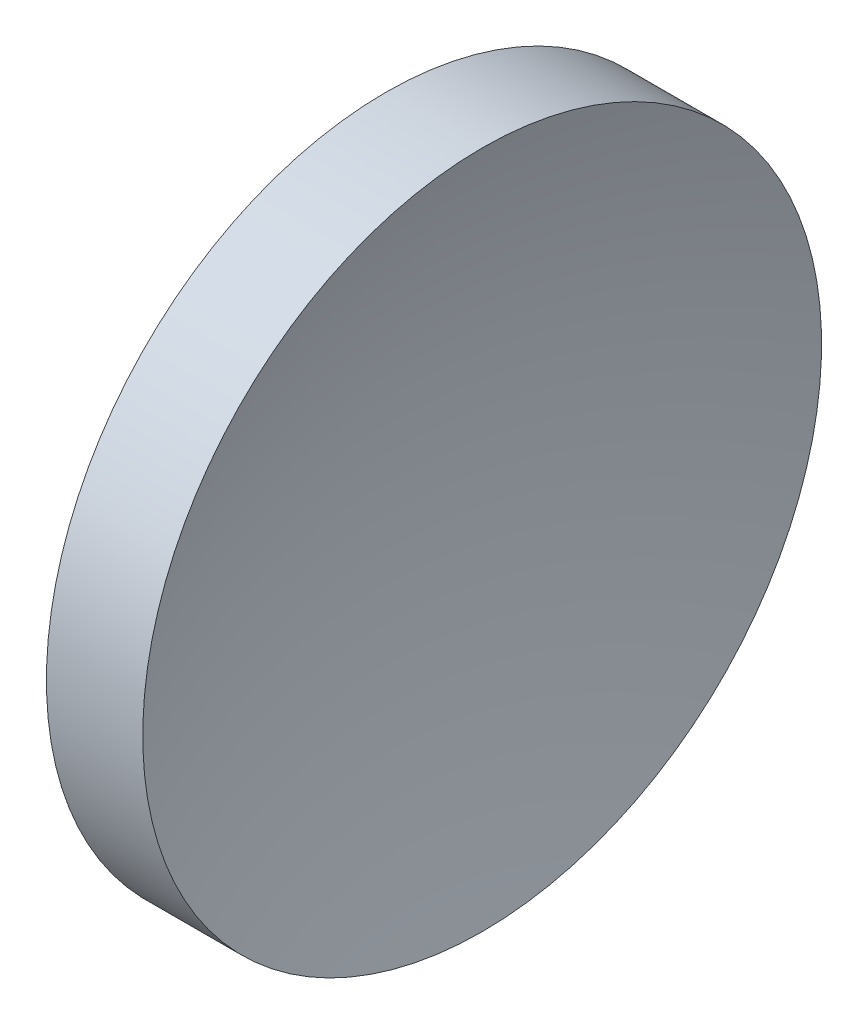
ISO-10303-21;
HEADER;
FILE_DESCRIPTION(('STEP AP214'),'2;1');
FILE_NAME('part.step','',(''),(''),'','','');
FILE_SCHEMA(('AUTOMOTIVE_DESIGN { 1 0 10303 214 1 1 1 1 }'));
ENDSEC;
DATA;
#1=APPLICATION_CONTEXT('core data for automotive mechanical design processes');
#2=APPLICATION_PROTOCOL_DEFINITION('international standard','automotive_design',2000,#1);
#3=PRODUCT_CONTEXT('',#1,'mechanical');
#4=PRODUCT('Part','Part','',(#3));
#5=PRODUCT_RELATED_PRODUCT_CATEGORY('part','',(#4));
#6=PRODUCT_DEFINITION_FORMATION('','',#4);
#7=PRODUCT_DEFINITION_CONTEXT('part definition',#1,'design');
#8=PRODUCT_DEFINITION('design','',#6,#7);
#9=PRODUCT_DEFINITION_SHAPE('','',#8);
#10=(LENGTH_UNIT() NAMED_UNIT(*) SI_UNIT(.MILLI.,.METRE.));
#11=(NAMED_UNIT(*) PLANE_ANGLE_UNIT() SI_UNIT($,.RADIAN.));
#12=(NAMED_UNIT(*) SI_UNIT($,.STERADIAN.) SOLID_ANGLE_UNIT());
#13=UNCERTAINTY_MEASURE_WITH_UNIT(LENGTH_MEASURE(1.E-05),#10,'distance_accuracy_value','');
#14=(GEOMETRIC_REPRESENTATION_CONTEXT(3) GLOBAL_UNCERTAINTY_ASSIGNED_CONTEXT((#13)) GLOBAL_UNIT_ASSIGNED_CONTEXT((#10,
#11,#12)) REPRESENTATION_CONTEXT('',''));
#15=CARTESIAN_POINT('',(0.,0.,0.));
#16=DIRECTION('',(0.,0.,1.));
#17=DIRECTION('',(1.,0.,0.));
#18=AXIS2_PLACEMENT_3D('',#15,#16,#17);
#19=CARTESIAN_POINT('',(182.025447260186,65.1574535691486,0.));
#20=DIRECTION('',(-1.,0.,0.));
#21=DIRECTION('',(0.,-1.,0.));
#22=AXIS2_PLACEMENT_3D('',#19,#20,#21);
#23=SPHERICAL_SURFACE('',#22,64.55);
#24=CARTESIAN_POINT('',(120.651979298024,65.1574518265862,0.));
#25=DIRECTION('',(-1.,0.,0.));
#26=DIRECTION('',(0.,-1.,0.));
#27=AXIS2_PLACEMENT_3D('',#24,#25,#26);
#28=CIRCLE('',#27,20.);
#29=CARTESIAN_POINT('',(120.651979298024,45.1574518265862,0.));
#30=VERTEX_POINT('',#29);
#31=EDGE_CURVE('E10',#30,#30,#28,.T.);
#32=ORIENTED_EDGE('',*,*,#31,.F.);
#33=EDGE_LOOP('',(#32));
#34=FACE_BOUND('',#33,.T.);
#35=ADVANCED_FACE('F35',(#34),#23,.F.);
#36=CARTESIAN_POINT('',(110.014789248842,65.1574518265862,0.));
#37=DIRECTION('',(-1.,0.,0.));
#38=DIRECTION('',(0.,-1.,0.));
#39=AXIS2_PLACEMENT_3D('',#36,#37,#38);
#40=CYLINDRICAL_SURFACE('',#39,20.);
#41=CARTESIAN_POINT('',(114.975447260186,65.1574518265862,0.));
#42=DIRECTION('',(-1.,0.,0.));
#43=DIRECTION('',(0.,-1.,0.));
#44=AXIS2_PLACEMENT_3D('',#41,#42,#43);
#45=CIRCLE('',#44,20.);
#46=CARTESIAN_POINT('',(114.975447260186,45.1574518265862,0.));
#47=VERTEX_POINT('',#46);
#48=EDGE_CURVE('E41',#47,#47,#45,.T.);
#49=ORIENTED_EDGE('',*,*,#48,.F.);
#50=EDGE_LOOP('',(#49));
#51=FACE_BOUND('',#50,.T.);
#52=ORIENTED_EDGE('',*,*,#31,.T.);
#53=EDGE_LOOP('',(#52));
#54=FACE_BOUND('',#53,.T.);
#55=ADVANCED_FACE('F49',(#51,#54),#40,.T.);
#56=CARTESIAN_POINT('',(114.975447260186,65.1574518265862,0.));
#57=DIRECTION('',(1.,0.,0.));
#58=DIRECTION('',(0.,1.,0.));
#59=AXIS2_PLACEMENT_3D('',#56,#57,#58);
#60=PLANE('',#59);
#61=ORIENTED_EDGE('',*,*,#48,.T.);
#62=EDGE_LOOP('',(#61));
#63=FACE_BOUND('',#62,.T.);
#64=ADVANCED_FACE('F47',(#63),#60,.F.);
#65=CLOSED_SHELL('',(#35,#55,#64));
#66=MANIFOLD_SOLID_BREP('B2',#65);
#67=ADVANCED_BREP_SHAPE_REPRESENTATION('',(#18,#66),#14);
#68=SHAPE_DEFINITION_REPRESENTATION(#9,#67);
ENDSEC;
END-ISO-10303-21;
